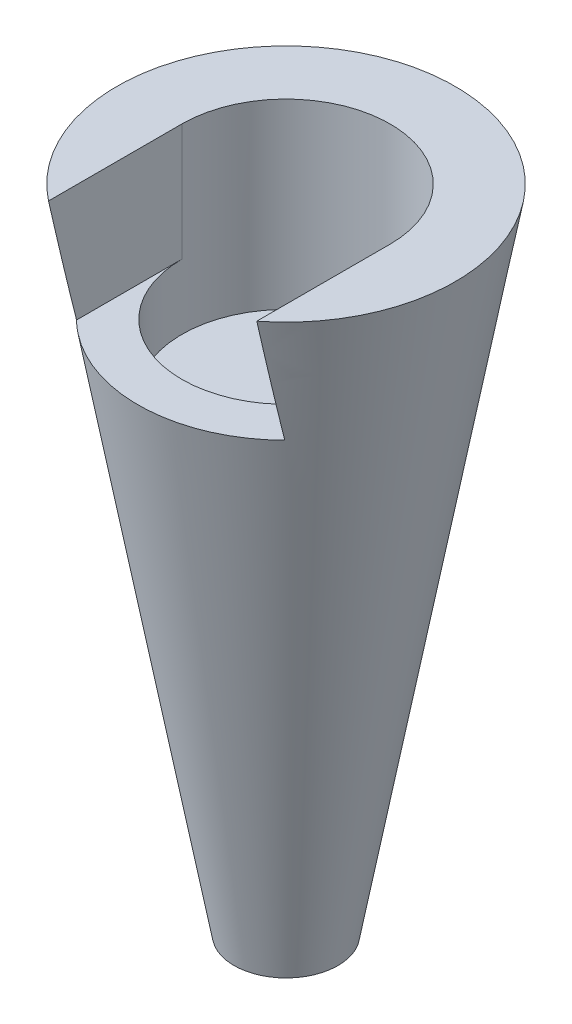
ISO-10303-21;
HEADER;
FILE_DESCRIPTION(('STEP AP214'),'2;1');
FILE_NAME('part.step','',(''),(''),'','','');
FILE_SCHEMA(('AUTOMOTIVE_DESIGN { 1 0 10303 214 1 1 1 1 }'));
ENDSEC;
DATA;
#1=APPLICATION_CONTEXT('core data for automotive mechanical design processes');
#2=APPLICATION_PROTOCOL_DEFINITION('international standard','automotive_design',2000,#1);
#3=PRODUCT_CONTEXT('',#1,'mechanical');
#4=PRODUCT('Part','Part','',(#3));
#5=PRODUCT_RELATED_PRODUCT_CATEGORY('part','',(#4));
#6=PRODUCT_DEFINITION_FORMATION('','',#4);
#7=PRODUCT_DEFINITION_CONTEXT('part definition',#1,'design');
#8=PRODUCT_DEFINITION('design','',#6,#7);
#9=PRODUCT_DEFINITION_SHAPE('','',#8);
#10=(LENGTH_UNIT() NAMED_UNIT(*) SI_UNIT(.MILLI.,.METRE.));
#11=(NAMED_UNIT(*) PLANE_ANGLE_UNIT() SI_UNIT($,.RADIAN.));
#12=(NAMED_UNIT(*) SI_UNIT($,.STERADIAN.) SOLID_ANGLE_UNIT());
#13=UNCERTAINTY_MEASURE_WITH_UNIT(LENGTH_MEASURE(1.E-05),#10,'distance_accuracy_value','');
#14=(GEOMETRIC_REPRESENTATION_CONTEXT(3) GLOBAL_UNCERTAINTY_ASSIGNED_CONTEXT((#13)) GLOBAL_UNIT_ASSIGNED_CONTEXT((#10,
#11,#12)) REPRESENTATION_CONTEXT('',''));
#15=CARTESIAN_POINT('',(0.,0.,0.));
#16=DIRECTION('',(0.,0.,1.));
#17=DIRECTION('',(1.,0.,0.));
#18=AXIS2_PLACEMENT_3D('',#15,#16,#17);
#19=CARTESIAN_POINT('',(0.,50.,0.));
#20=DIRECTION('',(0.,-1.,0.));
#21=DIRECTION('',(0.,0.,-1.));
#22=AXIS2_PLACEMENT_3D('',#19,#20,#21);
#23=PLANE('',#22);
#24=CARTESIAN_POINT('',(0.,50.,0.));
#25=DIRECTION('',(0.,1.,0.));
#26=DIRECTION('',(0.,0.,1.));
#27=AXIS2_PLACEMENT_3D('',#24,#25,#26);
#28=CIRCLE('',#27,8.);
#29=CARTESIAN_POINT('',(8.,50.,0.));
#30=VERTEX_POINT('',#29);
#31=CARTESIAN_POINT('',(-8.,50.,0.));
#32=VERTEX_POINT('',#31);
#33=EDGE_CURVE('E127',#30,#32,#28,.T.);
#34=ORIENTED_EDGE('',*,*,#33,.F.);
#35=DIRECTION('',(0.,0.,-1.));
#36=VECTOR('',#35,1.);
#37=CARTESIAN_POINT('',(8.,50.,14.0026063666069));
#38=LINE('',#37,#36);
#39=CARTESIAN_POINT('',(8.,50.,10.2469507659596));
#40=VERTEX_POINT('',#39);
#41=EDGE_CURVE('E137',#40,#30,#38,.T.);
#42=ORIENTED_EDGE('',*,*,#41,.F.);
#43=CARTESIAN_POINT('',(0.,50.,0.));
#44=DIRECTION('',(0.,-1.,0.));
#45=DIRECTION('',(0.,0.,-1.));
#46=AXIS2_PLACEMENT_3D('',#43,#44,#45);
#47=CIRCLE('',#46,13.);
#48=CARTESIAN_POINT('',(-8.,50.,10.2469507659596));
#49=VERTEX_POINT('',#48);
#50=EDGE_CURVE('E211',#49,#40,#47,.T.);
#51=ORIENTED_EDGE('',*,*,#50,.F.);
#52=DIRECTION('',(0.,0.,1.));
#53=VECTOR('',#52,1.);
#54=CARTESIAN_POINT('',(-8.,50.,0.));
#55=LINE('',#54,#53);
#56=EDGE_CURVE('E142',#32,#49,#55,.T.);
#57=ORIENTED_EDGE('',*,*,#56,.F.);
#58=EDGE_LOOP('',(#34,#42,#51,#57));
#59=FACE_BOUND('',#58,.T.);
#60=ADVANCED_FACE('F43',(#59),#23,.F.);
#61=CARTESIAN_POINT('',(0.,50.,0.));
#62=DIRECTION('',(0.,1.,0.));
#63=DIRECTION('',(0.,0.,1.));
#64=AXIS2_PLACEMENT_3D('',#61,#62,#63);
#65=CONICAL_SURFACE('',#64,13.,0.178092938231198);
#66=ORIENTED_EDGE('',*,*,#50,.T.);
#67=CARTESIAN_POINT('',(8.,65.8115883008419,13.6783931134044));
#68=CARTESIAN_POINT('',(8.,64.7113659856291,13.4489465452207));
#69=CARTESIAN_POINT('',(8.,63.6114274933253,13.2181301807225));
#70=CARTESIAN_POINT('',(8.,61.4122407612118,12.753198157199));
#71=CARTESIAN_POINT('',(8.,60.3129925259845,12.5190824765078));
#72=CARTESIAN_POINT('',(8.,58.1155123149761,12.0470357056708));
#73=CARTESIAN_POINT('',(8.,57.0172801969529,11.8091052784913));
#74=CARTESIAN_POINT('',(8.,54.8218237649391,11.3286417831862));
#75=CARTESIAN_POINT('',(8.,53.7245994494093,11.0861087221028));
#76=CARTESIAN_POINT('',(8.,51.5348766046208,10.5962561784101));
#77=CARTESIAN_POINT('',(8.,50.4423741334881,10.3489543426256));
#78=CARTESIAN_POINT('',(8.,48.2589312532486,9.84755190287889));
#79=CARTESIAN_POINT('',(8.,47.1679908381066,9.59345132525963));
#80=CARTESIAN_POINT('',(8.,44.9878207880701,9.07663198111332));
#81=CARTESIAN_POINT('',(8.,43.8985917294473,8.81391077872288));
#82=CARTESIAN_POINT('',(8.,41.7228302629805,8.27746129841987));
#83=CARTESIAN_POINT('',(8.,40.6362978570676,8.00373301262763));
#84=CARTESIAN_POINT('',(8.,38.9412689529541,7.56441532715352));
#85=CARTESIAN_POINT('',(8.,38.3314653104393,7.40387079946635));
#86=CARTESIAN_POINT('',(8.,37.1133947901869,7.07713846103163));
#87=CARTESIAN_POINT('',(8.,36.5051278484744,6.91095088951343));
#88=CARTESIAN_POINT('',(8.,35.2909558028574,6.57178904201844));
#89=CARTESIAN_POINT('',(8.,34.6850493164,6.39881972612426));
#90=CARTESIAN_POINT('',(8.,33.4756632393209,6.04422864754531));
#91=CARTESIAN_POINT('',(8.,32.8721840042885,5.86260566383091));
#92=CARTESIAN_POINT('',(8.,31.9688617005015,5.58158040946526));
#93=CARTESIAN_POINT('',(8.,31.6677177729945,5.48635661582566));
#94=CARTESIAN_POINT('',(8.,31.0664779423578,5.2926625127299));
#95=CARTESIAN_POINT('',(8.,30.7663820245504,5.19419224894522));
#96=CARTESIAN_POINT('',(8.,30.1675713127755,4.99350904713625));
#97=CARTESIAN_POINT('',(8.,29.8688560275501,4.89129757795482));
#98=CARTESIAN_POINT('',(8.,29.2729698899891,4.68240281504161));
#99=CARTESIAN_POINT('',(8.,28.9757991223934,4.57571927880122));
#100=CARTESIAN_POINT('',(8.,28.382742012229,4.35673117786153));
#101=CARTESIAN_POINT('',(8.,28.0868602885944,4.24441407056762));
#102=CARTESIAN_POINT('',(8.,27.4977139922372,4.01319264174049));
#103=CARTESIAN_POINT('',(8.,27.204449026747,3.89428932876678));
#104=CARTESIAN_POINT('',(8.,26.766991197906,3.70961499176963));
#105=CARTESIAN_POINT('',(8.,26.6214816898066,3.64695947519644));
#106=CARTESIAN_POINT('',(8.,26.3315139183619,3.51927154669418));
#107=CARTESIAN_POINT('',(8.,26.1870556134394,3.45423922939204));
#108=CARTESIAN_POINT('',(8.,25.8993150116434,3.32142483944275));
#109=CARTESIAN_POINT('',(8.,25.7560333470755,3.25364139154443));
#110=CARTESIAN_POINT('',(8.,25.470997454653,3.1148914165324));
#111=CARTESIAN_POINT('',(8.,25.3292434396315,3.04392445282174));
#112=CARTESIAN_POINT('',(8.,25.1884116991581,2.97114287202743));
#113=B_SPLINE_CURVE_WITH_KNOTS('',3,(#67,#68,#69,#70,#71,#72,#73,#74,#75,#76,#77,#78,#79,#80,
#81,#82,#83,#84,#85,#86,#87,#88,#89,#90,#91,#92,#93,#94,#95,#96,#97,#98,#99,#100,#101,#102,#103,
#104,#105,#106,#107,#108,#109,#110,#111,#112),.UNSPECIFIED.,.F.,.F.,(4,2,2,2,2,2,2,2,2,2,2,2,2,
2,2,2,2,2,2,2,2,2,4),(0.,3.37168001160246,6.74338217463252,10.1145045867608,13.4856218413291,
16.8460331068786,20.2064313537568,23.5677874405945,26.9291459337764,28.8208744995808,
30.7125229679437,32.602812813972,34.4933701737247,35.4408772395002,36.388370981391,
37.3354966339768,38.2826737133411,39.2320622950971,40.1813058947547,40.6565660475816,
41.1318072995698,41.6072891166961,42.0828363433882),.UNSPECIFIED.);
#114=CARTESIAN_POINT('',(8.,41.,8.09347885646216));
#115=VERTEX_POINT('',#114);
#116=EDGE_CURVE('E11',#40,#115,#113,.T.);
#117=ORIENTED_EDGE('',*,*,#116,.T.);
#118=CARTESIAN_POINT('',(0.,41.,0.));
#119=DIRECTION('',(0.,1.,0.));
#120=DIRECTION('',(0.,0.,1.));
#121=AXIS2_PLACEMENT_3D('',#118,#119,#120);
#122=CIRCLE('',#121,11.38);
#123=CARTESIAN_POINT('',(-8.,41.,8.09347885646216));
#124=VERTEX_POINT('',#123);
#125=EDGE_CURVE('E213',#124,#115,#122,.T.);
#126=ORIENTED_EDGE('',*,*,#125,.F.);
#127=CARTESIAN_POINT('',(-8.,25.1884116991581,2.97114287202741));
#128=CARTESIAN_POINT('',(-8.,25.3199408351026,3.03912472457198));
#129=CARTESIAN_POINT('',(-8.,25.4522782389179,3.10551502838005));
#130=CARTESIAN_POINT('',(-8.,25.7183052458901,3.23549179686113));
#131=CARTESIAN_POINT('',(-8.,25.8519946872098,3.2990785923394));
#132=CARTESIAN_POINT('',(-8.,26.2546167601448,3.48616792096854));
#133=CARTESIAN_POINT('',(-8.,26.5252259660631,3.60606191899826));
#134=CARTESIAN_POINT('',(-8.,27.0692917681626,3.83820263121339));
#135=CARTESIAN_POINT('',(-8.,27.3427445630522,3.95045833843292));
#136=CARTESIAN_POINT('',(-8.,27.8920754672866,4.16896078021995));
#137=CARTESIAN_POINT('',(-8.,28.1679539018186,4.27520669445763));
#138=CARTESIAN_POINT('',(-8.,28.7209349492299,4.48250989268235));
#139=CARTESIAN_POINT('',(-8.,28.9980333824087,4.58357836789521));
#140=CARTESIAN_POINT('',(-8.,29.5536875400259,4.78157014186631));
#141=CARTESIAN_POINT('',(-8.,29.8322431936879,4.87849363988399));
#142=CARTESIAN_POINT('',(-8.,30.6698974498681,5.16408130004945));
#143=CARTESIAN_POINT('',(-8.,31.2307881363827,5.34749056118892));
#144=CARTESIAN_POINT('',(-8.,32.3545783655183,5.70340344278442));
#145=CARTESIAN_POINT('',(-8.,32.917470389044,5.87593102571893));
#146=CARTESIAN_POINT('',(-8.,34.0456150986887,6.21278529618208));
#147=CARTESIAN_POINT('',(-8.,34.6108674632112,6.37711306381161));
#148=CARTESIAN_POINT('',(-8.,35.7436338603212,6.69931815968534));
#149=CARTESIAN_POINT('',(-8.,36.3111492112903,6.85719083653651));
#150=CARTESIAN_POINT('',(-8.,37.4476733241477,7.16754443197647));
#151=CARTESIAN_POINT('',(-8.,38.0166821446498,7.32002513544279));
#152=CARTESIAN_POINT('',(-8.,39.1479539545936,7.61838511683717));
#153=CARTESIAN_POINT('',(-8.,39.7102005271966,7.76432675754177));
#154=CARTESIAN_POINT('',(-8.,40.8356494523922,8.05248037564612));
#155=CARTESIAN_POINT('',(-8.,41.398851809044,8.19469233716382));
#156=CARTESIAN_POINT('',(-8.,43.0896511767794,8.61654378802005));
#157=CARTESIAN_POINT('',(-8.,44.2184422137973,8.89139929566873));
#158=CARTESIAN_POINT('',(-8.,46.478026592116,9.43135575180908));
#159=CARTESIAN_POINT('',(-8.,47.6088193228377,9.69645926854036));
#160=CARTESIAN_POINT('',(-8.,49.8721656233192,10.2190525570354));
#161=CARTESIAN_POINT('',(-8.,51.0047192015939,10.4765422918599));
#162=CARTESIAN_POINT('',(-8.,53.2752365184599,10.986306763255));
#163=CARTESIAN_POINT('',(-8.,54.4132051539639,11.2385596453109));
#164=CARTESIAN_POINT('',(-8.,56.6902525041553,11.7380122292584));
#165=CARTESIAN_POINT('',(-8.,57.8293312216826,11.985211918187));
#166=CARTESIAN_POINT('',(-8.,60.1085159505594,12.4754397420298));
#167=CARTESIAN_POINT('',(-8.,61.2486220611986,12.7184674147004));
#168=CARTESIAN_POINT('',(-8.,63.5295800853443,13.2009510498316));
#169=CARTESIAN_POINT('',(-8.,64.6704319924766,13.4404070424134));
#170=CARTESIAN_POINT('',(-8.,65.8115883008419,13.6783931134044));
#171=B_SPLINE_CURVE_WITH_KNOTS('',3,(#127,#128,#129,#130,#131,#132,#133,#134,#135,#136,#137,
#138,#139,#140,#141,#142,#143,#144,#145,#146,#147,#148,#149,#150,#151,#152,#153,#154,#155,#156,
#157,#158,#159,#160,#161,#162,#163,#164,#165,#166,#167,#168,#169,#170),.UNSPECIFIED.,.F.,.F.,(4,
2,2,2,2,2,2,2,2,2,2,2,2,2,2,2,2,2,2,2,2,4),(0.,0.444146567217617,0.888240585492278,
1.77601543021138,2.66272627913801,3.54955787244205,4.43438379801414,5.31916713986359,
7.08935788990114,8.85550362913827,10.6214161096197,12.3885794137581,14.1558131426857,
15.8984345451917,17.6410633670828,21.1263156523476,24.6106434088039,28.0949880671561,
31.5917497445984,35.08852039121,38.5856759984029,42.0828020963079),.UNSPECIFIED.);
#172=EDGE_CURVE('E56',#124,#49,#171,.T.);
#173=ORIENTED_EDGE('',*,*,#172,.T.);
#174=EDGE_LOOP('',(#66,#117,#126,#173));
#175=FACE_BOUND('',#174,.T.);
#176=CARTESIAN_POINT('',(-0.82782801596895,2.70175143221117,-4.40927719341029));
#177=CARTESIAN_POINT('',(-0.783015977006867,2.65528167388095,-4.40917909718544));
#178=CARTESIAN_POINT('',(-0.734263263662027,2.61257500534272,-4.4098494546748));
#179=CARTESIAN_POINT('',(-0.630273382963539,2.5359283709808,-4.41197343448397));
#180=CARTESIAN_POINT('',(-0.575031300852045,2.50199511281608,-4.41342765349564));
#181=CARTESIAN_POINT('',(-0.45966264069027,2.4438850150199,-4.41641398040845));
#182=CARTESIAN_POINT('',(-0.399538195293931,2.4197039428058,-4.41794605419375));
#183=CARTESIAN_POINT('',(-0.276088066639103,2.38176719583053,-4.42053343539053));
#184=CARTESIAN_POINT('',(-0.212762998634921,2.36800952545261,-4.42158883404843));
#185=CARTESIAN_POINT('',(-0.0846377953156266,2.35129918234166,-4.4228880066805));
#186=CARTESIAN_POINT('',(-0.0198364357630035,2.34835583201723,-4.42313108037935));
#187=CARTESIAN_POINT('',(0.109339569304224,2.35338630840921,-4.42272971652288));
#188=CARTESIAN_POINT('',(0.173714204963673,2.36136038638621,-4.42208525854136));
#189=CARTESIAN_POINT('',(0.300042086195951,2.3879608267614,-4.42010995350809));
#190=CARTESIAN_POINT('',(0.362000995863766,2.40656044259037,-4.41878083071499));
#191=CARTESIAN_POINT('',(0.481929718870556,2.45386461159563,-4.41587898236691));
#192=CARTESIAN_POINT('',(0.539899332106508,2.48256967121973,-4.41430624460505));
#193=CARTESIAN_POINT('',(0.650396461470494,2.54938663948992,-4.41154312451382));
#194=CARTESIAN_POINT('',(0.702906523731946,2.58752747531148,-4.41035394437627));
#195=CARTESIAN_POINT('',(0.80078466842376,2.6720953245713,-4.40910908579799));
#196=CARTESIAN_POINT('',(0.846153056409214,2.71852198332086,-4.40905335884961));
#197=CARTESIAN_POINT('',(0.928231276733997,2.81807091482254,-4.41081811771426));
#198=CARTESIAN_POINT('',(0.9649830112643,2.87115877247896,-4.41262928245518));
#199=CARTESIAN_POINT('',(1.02905076908077,2.98261730382106,-4.41873218057746));
#200=CARTESIAN_POINT('',(1.05636834305204,3.04098710732528,-4.42302350598655));
#201=CARTESIAN_POINT('',(1.10045757019153,3.16019932423348,-4.4343718016461));
#202=CARTESIAN_POINT('',(1.11739885668963,3.22098364427973,-4.44138104590123));
#203=CARTESIAN_POINT('',(1.14111002944348,3.34411681393446,-4.45823043852732));
#204=CARTESIAN_POINT('',(1.14787981472557,3.4064656790681,-4.4680706150001));
#205=CARTESIAN_POINT('',(1.15127476178842,3.53117819301163,-4.49037477559879));
#206=CARTESIAN_POINT('',(1.14786506491725,3.59354115969214,-4.5028476393388));
#207=CARTESIAN_POINT('',(1.13114808109204,3.71645735885741,-4.52988305267627));
#208=CARTESIAN_POINT('',(1.11783863934844,3.77701019436183,-4.54444605665897));
#209=CARTESIAN_POINT('',(1.08107975105626,3.89735213683174,-4.57559490554033));
#210=CARTESIAN_POINT('',(1.05722959131612,3.9570034448762,-4.59223987045328));
#211=CARTESIAN_POINT('',(1.00004390140879,4.07140589852405,-4.62610044853368));
#212=CARTESIAN_POINT('',(0.966705484171799,4.12615554598321,-4.64331623397856));
#213=CARTESIAN_POINT('',(0.889742375457359,4.23163989283822,-4.67801863480394));
#214=CARTESIAN_POINT('',(0.845744518383779,4.28210944236434,-4.69548626408116));
#215=CARTESIAN_POINT('',(0.74932473351922,4.37492226573201,-4.72874831576903));
#216=CARTESIAN_POINT('',(0.696902816379519,4.41726554984815,-4.74454274029522));
#217=CARTESIAN_POINT('',(0.585713100401153,4.49189588550315,-4.77307105979255));
#218=CARTESIAN_POINT('',(0.527047112467514,4.52431847121657,-4.78584560520872));
#219=CARTESIAN_POINT('',(0.404379131956786,4.57864257409992,-4.80757731519679));
#220=CARTESIAN_POINT('',(0.34038010774794,4.60054989876226,-4.81653658660408));
#221=CARTESIAN_POINT('',(0.213572360736395,4.63174886603022,-4.82938494459203));
#222=CARTESIAN_POINT('',(0.150981344155669,4.64180054438114,-4.83357876257298));
#223=CARTESIAN_POINT('',(0.0248672801953665,4.65146726898835,-4.83761087217999));
#224=CARTESIAN_POINT('',(-0.0386554351269502,4.65108594737062,-4.83745067960365));
#225=CARTESIAN_POINT('',(-0.161319222351819,4.64020639751668,-4.83291503488243));
#226=CARTESIAN_POINT('',(-0.22051634536453,4.63023541152337,-4.82875926439821));
#227=CARTESIAN_POINT('',(-0.336301180871449,4.60134569669821,-4.81686687095559));
#228=CARTESIAN_POINT('',(-0.392888760545363,4.58242651297227,-4.80913006595074));
#229=CARTESIAN_POINT('',(-0.502904561484165,4.53595854192161,-4.79047411339722));
#230=CARTESIAN_POINT('',(-0.556268668616014,4.50827801664093,-4.77950657484465));
#231=CARTESIAN_POINT('',(-0.657664141550619,4.44527442288522,-4.75516593358175));
#232=CARTESIAN_POINT('',(-0.705693982623002,4.40994917773084,-4.74179214592388));
#233=CARTESIAN_POINT('',(-0.79843292512508,4.33005581816102,-4.71250779258056));
#234=CARTESIAN_POINT('',(-0.842715319183259,4.28503234908679,-4.6964881903937));
#235=CARTESIAN_POINT('',(-0.923233979567437,4.18854258156357,-4.66362327120637));
#236=CARTESIAN_POINT('',(-0.959467339133443,4.13707396602747,-4.64677765857972));
#237=CARTESIAN_POINT('',(-1.02490904683814,4.02579443523914,-4.61228309499607));
#238=CARTESIAN_POINT('',(-1.05360010509249,3.96567542112416,-4.59464299931729));
#239=CARTESIAN_POINT('',(-1.10027097133828,3.84107075096475,-4.56062300569483));
#240=CARTESIAN_POINT('',(-1.11825076620064,3.7765850895681,-4.54424310929583));
#241=CARTESIAN_POINT('',(-1.14275401186483,3.64514639240137,-4.51374253997095));
#242=CARTESIAN_POINT('',(-1.14931125976985,3.57820123606721,-4.49961531490283));
#243=CARTESIAN_POINT('',(-1.1505850341769,3.44363999861004,-4.4742858682019));
#244=CARTESIAN_POINT('',(-1.14530440534783,3.37602408255945,-4.46308294457503));
#245=CARTESIAN_POINT('',(-1.1233543703006,3.24556103441555,-4.44443880044229));
#246=CARTESIAN_POINT('',(-1.10724671204198,3.18264121457897,-4.43684217107465));
#247=CARTESIAN_POINT('',(-1.06454983344559,3.06019316640019,-4.42461297882982));
#248=CARTESIAN_POINT('',(-1.03796891528606,3.00066229430575,-4.41997807579634));
#249=CARTESIAN_POINT('',(-0.982231513006304,2.89979028250137,-4.41405614991954));
#250=CARTESIAN_POINT('',(-0.955026911688713,2.85738615717959,-4.41224819920838));
#251=CARTESIAN_POINT('',(-0.895288903115048,2.77647644655239,-4.40989694243889));
#252=CARTESIAN_POINT('',(-0.862755431710486,2.73797090818685,-4.40935365160562));
#253=CARTESIAN_POINT('',(-0.82782801596895,2.70175143221117,-4.40927719341029));
#254=B_SPLINE_CURVE_WITH_KNOTS('',3,(#176,#177,#178,#179,#180,#181,#182,#183,#184,#185,#186,
#187,#188,#189,#190,#191,#192,#193,#194,#195,#196,#197,#198,#199,#200,#201,#202,#203,#204,#205,
#206,#207,#208,#209,#210,#211,#212,#213,#214,#215,#216,#217,#218,#219,#220,#221,#222,#223,#224,
#225,#226,#227,#228,#229,#230,#231,#232,#233,#234,#235,#236,#237,#238,#239,#240,#241,#242,#243,
#244,#245,#246,#247,#248,#249,#250,#251,#252,#253),.UNSPECIFIED.,.T.,.F.,(4,2,2,2,2,2,2,2,2,2,2,
2,2,2,2,2,2,2,2,2,2,2,2,2,2,2,2,2,2,2,2,2,2,2,2,2,2,2,4),(0.,0.193486403737257,
0.387120301822632,0.580670069461762,0.774182771578545,0.967862250873016,1.16154618770424,
1.35474471877083,1.54795293361859,1.74176096901704,1.93556071012278,2.12839750713593,
2.32120259262283,2.51076510869017,2.70032950655375,2.89054379310703,3.08079949403484,
3.2790103234239,3.47728152864412,3.68387882791978,3.89047586597843,4.09410948267995,
4.29763050442863,4.48723877389593,4.67678103431903,4.85646463371652,5.03615736856178,
5.21869178139272,5.40127823574724,5.59588362739646,5.79055918334732,5.99631627020353,
6.2020736092613,6.40722111153489,6.6123193216781,6.80752247717197,7.00257120496618,
7.15337663277521,7.30418387610069),.UNSPECIFIED.);
#255=CARTESIAN_POINT('',(-0.82782801596895,2.70175143221117,-4.40927719341029));
#256=VERTEX_POINT('',#255);
#257=EDGE_CURVE('E156',#256,#256,#254,.T.);
#258=ORIENTED_EDGE('',*,*,#257,.T.);
#259=EDGE_LOOP('',(#258));
#260=FACE_BOUND('',#259,.T.);
#261=CARTESIAN_POINT('',(0.,0.,0.));
#262=DIRECTION('',(0.,-1.,0.));
#263=DIRECTION('',(0.,0.,-1.));
#264=AXIS2_PLACEMENT_3D('',#261,#262,#263);
#265=CIRCLE('',#264,4.);
#266=CARTESIAN_POINT('',(0.,0.,-4.));
#267=VERTEX_POINT('',#266);
#268=EDGE_CURVE('E350',#267,#267,#265,.T.);
#269=ORIENTED_EDGE('',*,*,#268,.F.);
#270=EDGE_LOOP('',(#269));
#271=FACE_BOUND('',#270,.T.);
#272=ADVANCED_FACE('F166',(#175,#260,#271),#65,.T.);
#273=CARTESIAN_POINT('',(-4.,0.,0.));
#274=DIRECTION('',(0.,1.,0.));
#275=DIRECTION('',(0.,0.,1.));
#276=AXIS2_PLACEMENT_3D('',#273,#274,#275);
#277=PLANE('',#276);
#278=DIRECTION('',(-1.,0.,0.));
#279=VECTOR('',#278,1.);
#280=CARTESIAN_POINT('',(-2.25,0.,1.5));
#281=LINE('',#280,#279);
#282=CARTESIAN_POINT('',(2.25,0.,1.5));
#283=VERTEX_POINT('',#282);
#284=CARTESIAN_POINT('',(-2.25,0.,1.5));
#285=VERTEX_POINT('',#284);
#286=EDGE_CURVE('E375',#283,#285,#281,.T.);
#287=ORIENTED_EDGE('',*,*,#286,.F.);
#288=DIRECTION('',(0.,0.,1.));
#289=VECTOR('',#288,1.);
#290=CARTESIAN_POINT('',(2.25,0.,-1.5));
#291=LINE('',#290,#289);
#292=CARTESIAN_POINT('',(2.25,0.,-1.5));
#293=VERTEX_POINT('',#292);
#294=EDGE_CURVE('E71',#293,#283,#291,.T.);
#295=ORIENTED_EDGE('',*,*,#294,.F.);
#296=DIRECTION('',(1.,0.,0.));
#297=VECTOR('',#296,1.);
#298=CARTESIAN_POINT('',(-2.25,0.,-1.5));
#299=LINE('',#298,#297);
#300=CARTESIAN_POINT('',(-2.25,0.,-1.5));
#301=VERTEX_POINT('',#300);
#302=EDGE_CURVE('E367',#301,#293,#299,.T.);
#303=ORIENTED_EDGE('',*,*,#302,.F.);
#304=DIRECTION('',(0.,0.,-1.));
#305=VECTOR('',#304,1.);
#306=CARTESIAN_POINT('',(-2.25,0.,-1.5));
#307=LINE('',#306,#305);
#308=EDGE_CURVE('E371',#285,#301,#307,.T.);
#309=ORIENTED_EDGE('',*,*,#308,.F.);
#310=EDGE_LOOP('',(#287,#295,#303,#309));
#311=FACE_BOUND('',#310,.T.);
#312=ORIENTED_EDGE('',*,*,#268,.T.);
#313=EDGE_LOOP('',(#312));
#314=FACE_BOUND('',#313,.T.);
#315=ADVANCED_FACE('F195',(#311,#314),#277,.F.);
#316=CARTESIAN_POINT('',(2.25,6.,-1.5));
#317=DIRECTION('',(1.,0.,0.));
#318=DIRECTION('',(0.,0.,-1.));
#319=AXIS2_PLACEMENT_3D('',#316,#317,#318);
#320=PLANE('',#319);
#321=ORIENTED_EDGE('',*,*,#294,.T.);
#322=DIRECTION('',(0.,-1.,0.));
#323=VECTOR('',#322,1.);
#324=CARTESIAN_POINT('',(2.25,6.,1.5));
#325=LINE('',#324,#323);
#326=CARTESIAN_POINT('',(2.25,6.,1.5));
#327=VERTEX_POINT('',#326);
#328=EDGE_CURVE('E355',#327,#283,#325,.T.);
#329=ORIENTED_EDGE('',*,*,#328,.F.);
#330=DIRECTION('',(0.,0.,1.));
#331=VECTOR('',#330,1.);
#332=CARTESIAN_POINT('',(2.25,6.,-1.5));
#333=LINE('',#332,#331);
#334=CARTESIAN_POINT('',(2.25,6.,-1.5));
#335=VERTEX_POINT('',#334);
#336=EDGE_CURVE('E164',#335,#327,#333,.T.);
#337=ORIENTED_EDGE('',*,*,#336,.F.);
#338=DIRECTION('',(0.,-1.,0.));
#339=VECTOR('',#338,1.);
#340=CARTESIAN_POINT('',(2.25,6.,-1.5));
#341=LINE('',#340,#339);
#342=EDGE_CURVE('E354',#335,#293,#341,.T.);
#343=ORIENTED_EDGE('',*,*,#342,.T.);
#344=EDGE_LOOP('',(#321,#329,#337,#343));
#345=FACE_BOUND('',#344,.T.);
#346=ADVANCED_FACE('F186',(#345),#320,.F.);
#347=CARTESIAN_POINT('',(-2.25,6.,-1.5));
#348=DIRECTION('',(0.,0.,-1.));
#349=DIRECTION('',(-1.,0.,0.));
#350=AXIS2_PLACEMENT_3D('',#347,#348,#349);
#351=PLANE('',#350);
#352=CARTESIAN_POINT('',(0.,3.5,-1.5));
#353=DIRECTION('',(0.,0.,1.));
#354=DIRECTION('',(1.,0.,0.));
#355=AXIS2_PLACEMENT_3D('',#352,#353,#354);
#356=CIRCLE('',#355,1.15);
#357=CARTESIAN_POINT('',(1.15,3.5,-1.5));
#358=VERTEX_POINT('',#357);
#359=EDGE_CURVE('E151',#358,#358,#356,.T.);
#360=ORIENTED_EDGE('',*,*,#359,.F.);
#361=EDGE_LOOP('',(#360));
#362=FACE_BOUND('',#361,.T.);
#363=ORIENTED_EDGE('',*,*,#302,.T.);
#364=ORIENTED_EDGE('',*,*,#342,.F.);
#365=DIRECTION('',(1.,0.,0.));
#366=VECTOR('',#365,1.);
#367=CARTESIAN_POINT('',(-2.25,6.,-1.5));
#368=LINE('',#367,#366);
#369=CARTESIAN_POINT('',(-2.25,6.,-1.5));
#370=VERTEX_POINT('',#369);
#371=EDGE_CURVE('E359',#370,#335,#368,.T.);
#372=ORIENTED_EDGE('',*,*,#371,.F.);
#373=DIRECTION('',(0.,-1.,0.));
#374=VECTOR('',#373,1.);
#375=CARTESIAN_POINT('',(-2.25,6.,-1.5));
#376=LINE('',#375,#374);
#377=EDGE_CURVE('E362',#370,#301,#376,.T.);
#378=ORIENTED_EDGE('',*,*,#377,.T.);
#379=EDGE_LOOP('',(#363,#364,#372,#378));
#380=FACE_BOUND('',#379,.T.);
#381=ADVANCED_FACE('F182',(#362,#380),#351,.F.);
#382=CARTESIAN_POINT('',(-2.25,6.,-1.5));
#383=DIRECTION('',(-1.,0.,0.));
#384=DIRECTION('',(0.,0.,1.));
#385=AXIS2_PLACEMENT_3D('',#382,#383,#384);
#386=PLANE('',#385);
#387=ORIENTED_EDGE('',*,*,#308,.T.);
#388=ORIENTED_EDGE('',*,*,#377,.F.);
#389=DIRECTION('',(0.,0.,-1.));
#390=VECTOR('',#389,1.);
#391=CARTESIAN_POINT('',(-2.25,6.,-1.5));
#392=LINE('',#391,#390);
#393=CARTESIAN_POINT('',(-2.25,6.,1.5));
#394=VERTEX_POINT('',#393);
#395=EDGE_CURVE('E384',#394,#370,#392,.T.);
#396=ORIENTED_EDGE('',*,*,#395,.F.);
#397=DIRECTION('',(0.,-1.,0.));
#398=VECTOR('',#397,1.);
#399=CARTESIAN_POINT('',(-2.25,6.,1.5));
#400=LINE('',#399,#398);
#401=EDGE_CURVE('E358',#394,#285,#400,.T.);
#402=ORIENTED_EDGE('',*,*,#401,.T.);
#403=EDGE_LOOP('',(#387,#388,#396,#402));
#404=FACE_BOUND('',#403,.T.);
#405=ADVANCED_FACE('F185',(#404),#386,.F.);
#406=CARTESIAN_POINT('',(-2.25,6.,1.5));
#407=DIRECTION('',(0.,0.,1.));
#408=DIRECTION('',(1.,0.,0.));
#409=AXIS2_PLACEMENT_3D('',#406,#407,#408);
#410=PLANE('',#409);
#411=ORIENTED_EDGE('',*,*,#286,.T.);
#412=ORIENTED_EDGE('',*,*,#401,.F.);
#413=DIRECTION('',(-1.,0.,0.));
#414=VECTOR('',#413,1.);
#415=CARTESIAN_POINT('',(-2.25,6.,1.5));
#416=LINE('',#415,#414);
#417=EDGE_CURVE('E387',#327,#394,#416,.T.);
#418=ORIENTED_EDGE('',*,*,#417,.F.);
#419=ORIENTED_EDGE('',*,*,#328,.T.);
#420=EDGE_LOOP('',(#411,#412,#418,#419));
#421=FACE_BOUND('',#420,.T.);
#422=ADVANCED_FACE('F180',(#421),#410,.F.);
#423=CARTESIAN_POINT('',(0.,6.,0.));
#424=DIRECTION('',(0.,1.,0.));
#425=DIRECTION('',(0.,0.,1.));
#426=AXIS2_PLACEMENT_3D('',#423,#424,#425);
#427=PLANE('',#426);
#428=ORIENTED_EDGE('',*,*,#336,.T.);
#429=ORIENTED_EDGE('',*,*,#417,.T.);
#430=ORIENTED_EDGE('',*,*,#395,.T.);
#431=ORIENTED_EDGE('',*,*,#371,.T.);
#432=EDGE_LOOP('',(#428,#429,#430,#431));
#433=FACE_BOUND('',#432,.T.);
#434=ADVANCED_FACE('F175',(#433),#427,.F.);
#435=CARTESIAN_POINT('',(0.,3.5,-7.5));
#436=DIRECTION('',(0.,0.,1.));
#437=DIRECTION('',(1.,0.,0.));
#438=AXIS2_PLACEMENT_3D('',#435,#436,#437);
#439=CYLINDRICAL_SURFACE('',#438,1.15);
#440=ORIENTED_EDGE('',*,*,#359,.T.);
#441=EDGE_LOOP('',(#440));
#442=FACE_BOUND('',#441,.T.);
#443=ORIENTED_EDGE('',*,*,#257,.F.);
#444=EDGE_LOOP('',(#443));
#445=FACE_BOUND('',#444,.T.);
#446=ADVANCED_FACE('F169',(#442,#445),#439,.F.);
#447=CARTESIAN_POINT('',(8.,41.,14.0026063666069));
#448=DIRECTION('',(1.,0.,0.));
#449=DIRECTION('',(0.,0.,-1.));
#450=AXIS2_PLACEMENT_3D('',#447,#448,#449);
#451=PLANE('',#450);
#452=ORIENTED_EDGE('',*,*,#41,.T.);
#453=DIRECTION('',(0.,1.,0.));
#454=VECTOR('',#453,1.);
#455=CARTESIAN_POINT('',(8.,41.,0.));
#456=LINE('',#455,#454);
#457=CARTESIAN_POINT('',(8.,41.,0.));
#458=VERTEX_POINT('',#457);
#459=EDGE_CURVE('E131',#458,#30,#456,.T.);
#460=ORIENTED_EDGE('',*,*,#459,.F.);
#461=DIRECTION('',(0.,0.,-1.));
#462=VECTOR('',#461,1.);
#463=CARTESIAN_POINT('',(8.,41.,14.0026063666069));
#464=LINE('',#463,#462);
#465=EDGE_CURVE('E115',#115,#458,#464,.T.);
#466=ORIENTED_EDGE('',*,*,#465,.F.);
#467=ORIENTED_EDGE('',*,*,#116,.F.);
#468=EDGE_LOOP('',(#452,#460,#466,#467));
#469=FACE_BOUND('',#468,.T.);
#470=ADVANCED_FACE('F174',(#469),#451,.F.);
#471=CARTESIAN_POINT('',(-8.,41.,0.));
#472=DIRECTION('',(-1.,0.,0.));
#473=DIRECTION('',(0.,0.,1.));
#474=AXIS2_PLACEMENT_3D('',#471,#472,#473);
#475=PLANE('',#474);
#476=DIRECTION('',(0.,0.,1.));
#477=VECTOR('',#476,1.);
#478=CARTESIAN_POINT('',(-8.,41.,0.));
#479=LINE('',#478,#477);
#480=CARTESIAN_POINT('',(-8.,41.,0.));
#481=VERTEX_POINT('',#480);
#482=EDGE_CURVE('E63',#481,#124,#479,.T.);
#483=ORIENTED_EDGE('',*,*,#482,.F.);
#484=DIRECTION('',(0.,1.,0.));
#485=VECTOR('',#484,1.);
#486=CARTESIAN_POINT('',(-8.,41.,0.));
#487=LINE('',#486,#485);
#488=EDGE_CURVE('E123',#481,#32,#487,.T.);
#489=ORIENTED_EDGE('',*,*,#488,.T.);
#490=ORIENTED_EDGE('',*,*,#56,.T.);
#491=ORIENTED_EDGE('',*,*,#172,.F.);
#492=EDGE_LOOP('',(#483,#489,#490,#491));
#493=FACE_BOUND('',#492,.T.);
#494=ADVANCED_FACE('F133',(#493),#475,.F.);
#495=CARTESIAN_POINT('',(0.,41.,0.));
#496=DIRECTION('',(0.,1.,0.));
#497=DIRECTION('',(0.,0.,1.));
#498=AXIS2_PLACEMENT_3D('',#495,#496,#497);
#499=PLANE('',#498);
#500=CARTESIAN_POINT('',(0.,41.,0.));
#501=DIRECTION('',(0.,1.,0.));
#502=DIRECTION('',(0.,0.,1.));
#503=AXIS2_PLACEMENT_3D('',#500,#501,#502);
#504=CIRCLE('',#503,8.);
#505=EDGE_CURVE('E111',#481,#458,#504,.T.);
#506=ORIENTED_EDGE('',*,*,#505,.F.);
#507=ORIENTED_EDGE('',*,*,#482,.T.);
#508=ORIENTED_EDGE('',*,*,#125,.T.);
#509=ORIENTED_EDGE('',*,*,#465,.T.);
#510=EDGE_LOOP('',(#506,#507,#508,#509));
#511=FACE_BOUND('',#510,.T.);
#512=ADVANCED_FACE('F113',(#511),#499,.T.);
#513=CARTESIAN_POINT('',(0.,41.,0.));
#514=DIRECTION('',(0.,1.,0.));
#515=DIRECTION('',(0.,0.,1.));
#516=AXIS2_PLACEMENT_3D('',#513,#514,#515);
#517=CYLINDRICAL_SURFACE('',#516,8.);
#518=ORIENTED_EDGE('',*,*,#33,.T.);
#519=ORIENTED_EDGE('',*,*,#488,.F.);
#520=ORIENTED_EDGE('',*,*,#505,.T.);
#521=ORIENTED_EDGE('',*,*,#459,.T.);
#522=EDGE_LOOP('',(#518,#519,#520,#521));
#523=FACE_BOUND('',#522,.T.);
#524=CARTESIAN_POINT('',(0.,36.,0.));
#525=DIRECTION('',(0.,1.,0.));
#526=DIRECTION('',(0.,0.,1.));
#527=AXIS2_PLACEMENT_3D('',#524,#525,#526);
#528=CIRCLE('',#527,8.);
#529=CARTESIAN_POINT('',(0.,36.,8.));
#530=VERTEX_POINT('',#529);
#531=EDGE_CURVE('E120',#530,#530,#528,.T.);
#532=ORIENTED_EDGE('',*,*,#531,.F.);
#533=EDGE_LOOP('',(#532));
#534=FACE_BOUND('',#533,.T.);
#535=ADVANCED_FACE('F124',(#523,#534),#517,.F.);
#536=CARTESIAN_POINT('',(0.,36.,0.));
#537=DIRECTION('',(0.,1.,0.));
#538=DIRECTION('',(0.,0.,1.));
#539=AXIS2_PLACEMENT_3D('',#536,#537,#538);
#540=PLANE('',#539);
#541=ORIENTED_EDGE('',*,*,#531,.T.);
#542=EDGE_LOOP('',(#541));
#543=FACE_BOUND('',#542,.T.);
#544=ADVANCED_FACE('F230',(#543),#540,.T.);
#545=CLOSED_SHELL('',(#60,#272,#315,#346,#381,#405,#422,#434,#446,#470,#494,#512,#535,#544));
#546=MANIFOLD_SOLID_BREP('B2',#545);
#547=ADVANCED_BREP_SHAPE_REPRESENTATION('',(#18,#546),#14);
#548=SHAPE_DEFINITION_REPRESENTATION(#9,#547);
ENDSEC;
END-ISO-10303-21;
